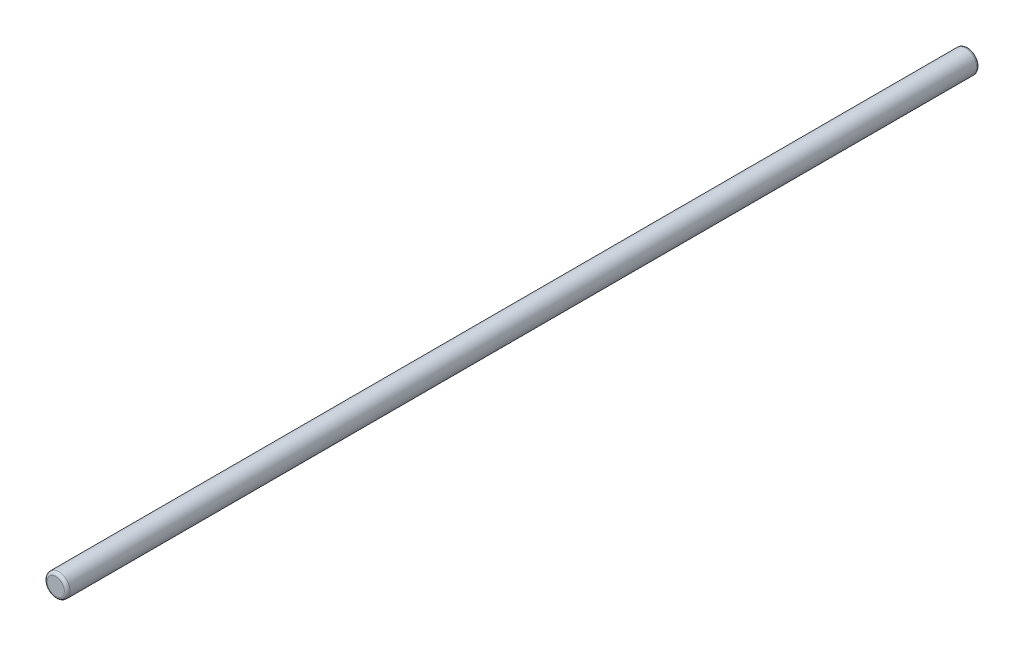
ISO-10303-21;
HEADER;
FILE_DESCRIPTION(('STEP AP214'),'2;1');
FILE_NAME('part.step','',(''),(''),'','','');
FILE_SCHEMA(('AUTOMOTIVE_DESIGN { 1 0 10303 214 1 1 1 1 }'));
ENDSEC;
DATA;
#1=APPLICATION_CONTEXT('core data for automotive mechanical design processes');
#2=APPLICATION_PROTOCOL_DEFINITION('international standard','automotive_design',2000,#1);
#3=PRODUCT_CONTEXT('',#1,'mechanical');
#4=PRODUCT('Part','Part','',(#3));
#5=PRODUCT_RELATED_PRODUCT_CATEGORY('part','',(#4));
#6=PRODUCT_DEFINITION_FORMATION('','',#4);
#7=PRODUCT_DEFINITION_CONTEXT('part definition',#1,'design');
#8=PRODUCT_DEFINITION('design','',#6,#7);
#9=PRODUCT_DEFINITION_SHAPE('','',#8);
#10=(LENGTH_UNIT() NAMED_UNIT(*) SI_UNIT(.MILLI.,.METRE.));
#11=(NAMED_UNIT(*) PLANE_ANGLE_UNIT() SI_UNIT($,.RADIAN.));
#12=(NAMED_UNIT(*) SI_UNIT($,.STERADIAN.) SOLID_ANGLE_UNIT());
#13=UNCERTAINTY_MEASURE_WITH_UNIT(LENGTH_MEASURE(1.E-05),#10,'distance_accuracy_value','');
#14=(GEOMETRIC_REPRESENTATION_CONTEXT(3) GLOBAL_UNCERTAINTY_ASSIGNED_CONTEXT((#13)) GLOBAL_UNIT_ASSIGNED_CONTEXT((#10,
#11,#12)) REPRESENTATION_CONTEXT('',''));
#15=CARTESIAN_POINT('',(0.,0.,0.));
#16=DIRECTION('',(0.,0.,1.));
#17=DIRECTION('',(1.,0.,0.));
#18=AXIS2_PLACEMENT_3D('',#15,#16,#17);
#19=CARTESIAN_POINT('',(0.,0.,318.625));
#20=DIRECTION('',(0.,0.,-1.));
#21=DIRECTION('',(-1.,0.,0.));
#22=AXIS2_PLACEMENT_3D('',#19,#20,#21);
#23=CYLINDRICAL_SURFACE('',#22,4.);
#24=CARTESIAN_POINT('',(0.,0.,317.625));
#25=DIRECTION('',(0.,0.,1.));
#26=DIRECTION('',(1.,0.,0.));
#27=AXIS2_PLACEMENT_3D('',#24,#25,#26);
#28=CIRCLE('',#27,4.);
#29=CARTESIAN_POINT('',(4.,0.,317.625));
#30=VERTEX_POINT('',#29);
#31=EDGE_CURVE('E10',#30,#30,#28,.F.);
#32=ORIENTED_EDGE('',*,*,#31,.T.);
#33=EDGE_LOOP('',(#32));
#34=FACE_BOUND('',#33,.T.);
#35=CARTESIAN_POINT('',(0.,0.,1.));
#36=DIRECTION('',(0.,0.,1.));
#37=DIRECTION('',(1.,0.,0.));
#38=AXIS2_PLACEMENT_3D('',#35,#36,#37);
#39=CIRCLE('',#38,4.);
#40=CARTESIAN_POINT('',(4.,0.,1.));
#41=VERTEX_POINT('',#40);
#42=EDGE_CURVE('E44',#41,#41,#39,.T.);
#43=ORIENTED_EDGE('',*,*,#42,.T.);
#44=EDGE_LOOP('',(#43));
#45=FACE_BOUND('',#44,.T.);
#46=ADVANCED_FACE('F29',(#34,#45),#23,.T.);
#47=CARTESIAN_POINT('',(0.,0.,318.625));
#48=DIRECTION('',(0.,0.,1.));
#49=DIRECTION('',(1.,0.,0.));
#50=AXIS2_PLACEMENT_3D('',#47,#48,#49);
#51=PLANE('',#50);
#52=CARTESIAN_POINT('',(0.,0.,318.625));
#53=DIRECTION('',(0.,0.,1.));
#54=DIRECTION('',(1.,0.,0.));
#55=AXIS2_PLACEMENT_3D('',#52,#53,#54);
#56=CIRCLE('',#55,3.);
#57=CARTESIAN_POINT('',(3.,0.,318.625));
#58=VERTEX_POINT('',#57);
#59=EDGE_CURVE('E36',#58,#58,#56,.T.);
#60=ORIENTED_EDGE('',*,*,#59,.T.);
#61=EDGE_LOOP('',(#60));
#62=FACE_BOUND('',#61,.T.);
#63=ADVANCED_FACE('F60',(#62),#51,.T.);
#64=CARTESIAN_POINT('',(0.,0.,0.));
#65=DIRECTION('',(0.,0.,1.));
#66=DIRECTION('',(1.,0.,0.));
#67=AXIS2_PLACEMENT_3D('',#64,#65,#66);
#68=PLANE('',#67);
#69=CARTESIAN_POINT('',(0.,0.,0.));
#70=DIRECTION('',(0.,0.,1.));
#71=DIRECTION('',(1.,0.,0.));
#72=AXIS2_PLACEMENT_3D('',#69,#70,#71);
#73=CIRCLE('',#72,3.);
#74=CARTESIAN_POINT('',(3.,0.,0.));
#75=VERTEX_POINT('',#74);
#76=EDGE_CURVE('E40',#75,#75,#73,.F.);
#77=ORIENTED_EDGE('',*,*,#76,.T.);
#78=EDGE_LOOP('',(#77));
#79=FACE_BOUND('',#78,.T.);
#80=ADVANCED_FACE('F53',(#79),#68,.F.);
#81=CARTESIAN_POINT('',(0.,0.,1.));
#82=DIRECTION('',(0.,0.,1.));
#83=DIRECTION('',(1.,0.,0.));
#84=AXIS2_PLACEMENT_3D('',#81,#82,#83);
#85=TOROIDAL_SURFACE('',#84,3.,1.);
#86=ORIENTED_EDGE('',*,*,#76,.F.);
#87=EDGE_LOOP('',(#86));
#88=FACE_BOUND('',#87,.T.);
#89=ORIENTED_EDGE('',*,*,#42,.F.);
#90=EDGE_LOOP('',(#89));
#91=FACE_BOUND('',#90,.T.);
#92=ADVANCED_FACE('F51',(#88,#91),#85,.T.);
#93=CARTESIAN_POINT('',(0.,0.,317.625));
#94=DIRECTION('',(0.,0.,1.));
#95=DIRECTION('',(1.,0.,0.));
#96=AXIS2_PLACEMENT_3D('',#93,#94,#95);
#97=TOROIDAL_SURFACE('',#96,3.,1.);
#98=ORIENTED_EDGE('',*,*,#31,.F.);
#99=EDGE_LOOP('',(#98));
#100=FACE_BOUND('',#99,.T.);
#101=ORIENTED_EDGE('',*,*,#59,.F.);
#102=EDGE_LOOP('',(#101));
#103=FACE_BOUND('',#102,.T.);
#104=ADVANCED_FACE('F31',(#100,#103),#97,.T.);
#105=CLOSED_SHELL('',(#46,#63,#80,#92,#104));
#106=MANIFOLD_SOLID_BREP('B2',#105);
#107=ADVANCED_BREP_SHAPE_REPRESENTATION('',(#18,#106),#14);
#108=SHAPE_DEFINITION_REPRESENTATION(#9,#107);
ENDSEC;
END-ISO-10303-21;
